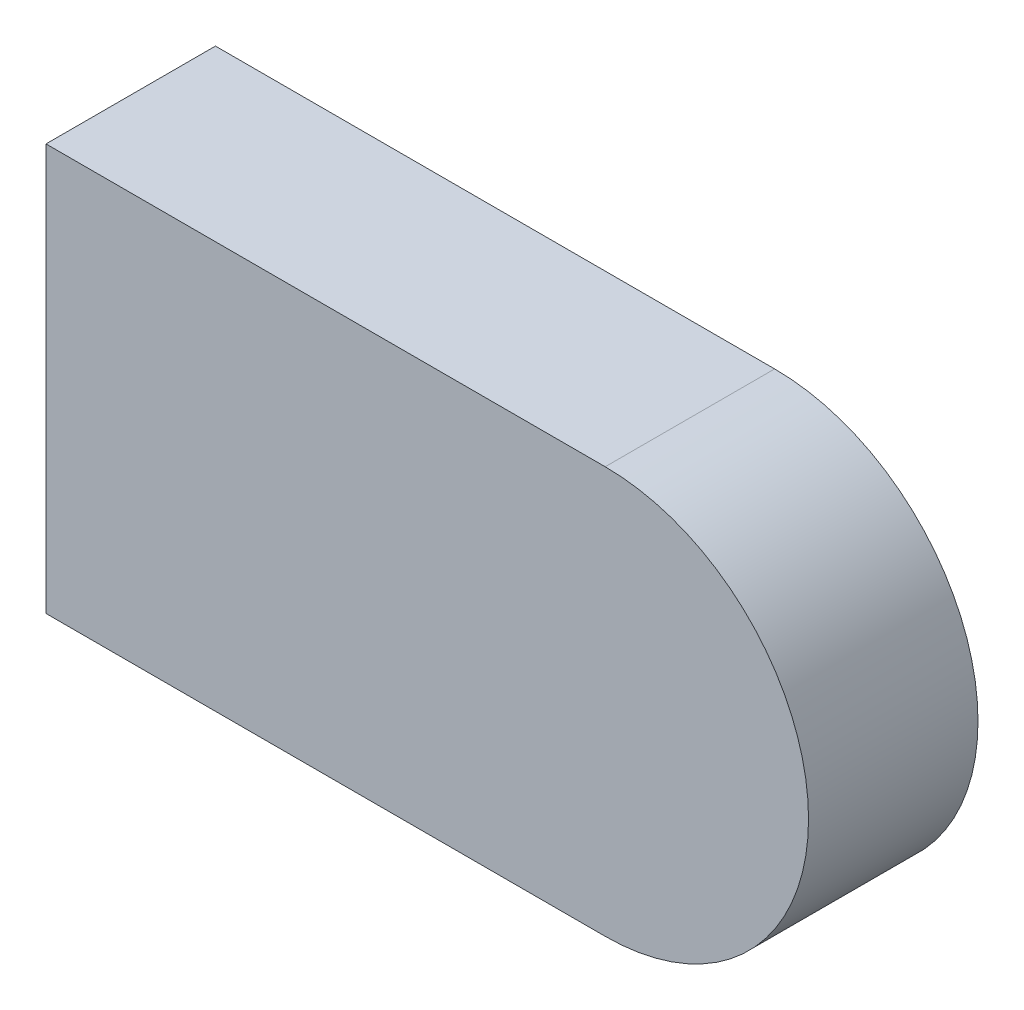
ISO-10303-21;
HEADER;
FILE_DESCRIPTION(('STEP AP214'),'2;1');
FILE_NAME('part.step','',(''),(''),'','','');
FILE_SCHEMA(('AUTOMOTIVE_DESIGN { 1 0 10303 214 1 1 1 1 }'));
ENDSEC;
DATA;
#1=APPLICATION_CONTEXT('core data for automotive mechanical design processes');
#2=APPLICATION_PROTOCOL_DEFINITION('international standard','automotive_design',2000,#1);
#3=PRODUCT_CONTEXT('',#1,'mechanical');
#4=PRODUCT('Part','Part','',(#3));
#5=PRODUCT_RELATED_PRODUCT_CATEGORY('part','',(#4));
#6=PRODUCT_DEFINITION_FORMATION('','',#4);
#7=PRODUCT_DEFINITION_CONTEXT('part definition',#1,'design');
#8=PRODUCT_DEFINITION('design','',#6,#7);
#9=PRODUCT_DEFINITION_SHAPE('','',#8);
#10=(LENGTH_UNIT() NAMED_UNIT(*) SI_UNIT(.MILLI.,.METRE.));
#11=(NAMED_UNIT(*) PLANE_ANGLE_UNIT() SI_UNIT($,.RADIAN.));
#12=(NAMED_UNIT(*) SI_UNIT($,.STERADIAN.) SOLID_ANGLE_UNIT());
#13=UNCERTAINTY_MEASURE_WITH_UNIT(LENGTH_MEASURE(1.E-05),#10,'distance_accuracy_value','');
#14=(GEOMETRIC_REPRESENTATION_CONTEXT(3) GLOBAL_UNCERTAINTY_ASSIGNED_CONTEXT((#13)) GLOBAL_UNIT_ASSIGNED_CONTEXT((#10,
#11,#12)) REPRESENTATION_CONTEXT('',''));
#15=CARTESIAN_POINT('',(0.,0.,0.));
#16=DIRECTION('',(0.,0.,1.));
#17=DIRECTION('',(1.,0.,0.));
#18=AXIS2_PLACEMENT_3D('',#15,#16,#17);
#19=CARTESIAN_POINT('',(-4.05,0.63,0.));
#20=DIRECTION('',(0.,1.,0.));
#21=DIRECTION('',(1.,0.,0.));
#22=AXIS2_PLACEMENT_3D('',#19,#20,#21);
#23=PLANE('',#22);
#24=DIRECTION('',(1.,0.,0.));
#25=VECTOR('',#24,1.);
#26=CARTESIAN_POINT('',(-4.05,0.63,0.));
#27=LINE('',#26,#25);
#28=CARTESIAN_POINT('',(-4.05,0.63,0.));
#29=VERTEX_POINT('',#28);
#30=CARTESIAN_POINT('',(-3.72,0.63,0.));
#31=VERTEX_POINT('',#30);
#32=EDGE_CURVE('E11',#29,#31,#27,.T.);
#33=ORIENTED_EDGE('',*,*,#32,.T.);
#34=DIRECTION('',(0.,0.,1.));
#35=VECTOR('',#34,1.);
#36=CARTESIAN_POINT('',(-3.72,0.63,0.));
#37=LINE('',#36,#35);
#38=CARTESIAN_POINT('',(-3.72,0.63,0.1));
#39=VERTEX_POINT('',#38);
#40=EDGE_CURVE('E24',#31,#39,#37,.T.);
#41=ORIENTED_EDGE('',*,*,#40,.T.);
#42=DIRECTION('',(1.,0.,0.));
#43=VECTOR('',#42,1.);
#44=CARTESIAN_POINT('',(-4.05,0.63,0.1));
#45=LINE('',#44,#43);
#46=CARTESIAN_POINT('',(-4.05,0.63,0.1));
#47=VERTEX_POINT('',#46);
#48=EDGE_CURVE('E88',#47,#39,#45,.T.);
#49=ORIENTED_EDGE('',*,*,#48,.F.);
#50=DIRECTION('',(0.,0.,1.));
#51=VECTOR('',#50,1.);
#52=CARTESIAN_POINT('',(-4.05,0.63,0.));
#53=LINE('',#52,#51);
#54=EDGE_CURVE('E36',#29,#47,#53,.T.);
#55=ORIENTED_EDGE('',*,*,#54,.F.);
#56=EDGE_LOOP('',(#33,#41,#49,#55));
#57=FACE_BOUND('',#56,.T.);
#58=ADVANCED_FACE('F17',(#57),#23,.F.);
#59=CARTESIAN_POINT('',(-3.72,0.75,0.));
#60=DIRECTION('',(0.,0.,-1.));
#61=DIRECTION('',(1.,0.,0.));
#62=AXIS2_PLACEMENT_3D('',#59,#60,#61);
#63=CYLINDRICAL_SURFACE('',#62,0.12);
#64=CARTESIAN_POINT('',(-3.72,0.75,0.));
#65=DIRECTION('',(0.,0.,1.));
#66=DIRECTION('',(1.,0.,0.));
#67=AXIS2_PLACEMENT_3D('',#64,#65,#66);
#68=CIRCLE('',#67,0.12);
#69=CARTESIAN_POINT('',(-3.72,0.87,0.));
#70=VERTEX_POINT('',#69);
#71=EDGE_CURVE('E85',#31,#70,#68,.T.);
#72=ORIENTED_EDGE('',*,*,#71,.T.);
#73=DIRECTION('',(0.,0.,1.));
#74=VECTOR('',#73,1.);
#75=CARTESIAN_POINT('',(-3.72,0.87,0.));
#76=LINE('',#75,#74);
#77=CARTESIAN_POINT('',(-3.72,0.87,0.1));
#78=VERTEX_POINT('',#77);
#79=EDGE_CURVE('E73',#70,#78,#76,.T.);
#80=ORIENTED_EDGE('',*,*,#79,.T.);
#81=CARTESIAN_POINT('',(-3.72,0.75,0.1));
#82=DIRECTION('',(0.,0.,1.));
#83=DIRECTION('',(1.,0.,0.));
#84=AXIS2_PLACEMENT_3D('',#81,#82,#83);
#85=CIRCLE('',#84,0.12);
#86=EDGE_CURVE('E66',#39,#78,#85,.T.);
#87=ORIENTED_EDGE('',*,*,#86,.F.);
#88=ORIENTED_EDGE('',*,*,#40,.F.);
#89=EDGE_LOOP('',(#72,#80,#87,#88));
#90=FACE_BOUND('',#89,.T.);
#91=ADVANCED_FACE('F89',(#90),#63,.T.);
#92=CARTESIAN_POINT('',(-4.05,0.87,0.));
#93=DIRECTION('',(0.,1.,0.));
#94=DIRECTION('',(1.,0.,0.));
#95=AXIS2_PLACEMENT_3D('',#92,#93,#94);
#96=PLANE('',#95);
#97=DIRECTION('',(0.,0.,1.));
#98=VECTOR('',#97,1.);
#99=CARTESIAN_POINT('',(-4.05,0.87,0.));
#100=LINE('',#99,#98);
#101=CARTESIAN_POINT('',(-4.05,0.87,0.));
#102=VERTEX_POINT('',#101);
#103=CARTESIAN_POINT('',(-4.05,0.87,0.1));
#104=VERTEX_POINT('',#103);
#105=EDGE_CURVE('E56',#102,#104,#100,.T.);
#106=ORIENTED_EDGE('',*,*,#105,.T.);
#107=DIRECTION('',(1.,0.,0.));
#108=VECTOR('',#107,1.);
#109=CARTESIAN_POINT('',(-4.05,0.87,0.1));
#110=LINE('',#109,#108);
#111=EDGE_CURVE('E67',#104,#78,#110,.T.);
#112=ORIENTED_EDGE('',*,*,#111,.T.);
#113=ORIENTED_EDGE('',*,*,#79,.F.);
#114=DIRECTION('',(1.,0.,0.));
#115=VECTOR('',#114,1.);
#116=CARTESIAN_POINT('',(-4.05,0.87,0.));
#117=LINE('',#116,#115);
#118=EDGE_CURVE('E71',#102,#70,#117,.T.);
#119=ORIENTED_EDGE('',*,*,#118,.F.);
#120=EDGE_LOOP('',(#106,#112,#113,#119));
#121=FACE_BOUND('',#120,.T.);
#122=ADVANCED_FACE('F72',(#121),#96,.T.);
#123=CARTESIAN_POINT('',(-4.05,0.63,0.));
#124=DIRECTION('',(-1.,0.,0.));
#125=DIRECTION('',(0.,1.,0.));
#126=AXIS2_PLACEMENT_3D('',#123,#124,#125);
#127=PLANE('',#126);
#128=ORIENTED_EDGE('',*,*,#54,.T.);
#129=DIRECTION('',(0.,1.,0.));
#130=VECTOR('',#129,1.);
#131=CARTESIAN_POINT('',(-4.05,0.63,0.1));
#132=LINE('',#131,#130);
#133=EDGE_CURVE('E62',#47,#104,#132,.T.);
#134=ORIENTED_EDGE('',*,*,#133,.T.);
#135=ORIENTED_EDGE('',*,*,#105,.F.);
#136=DIRECTION('',(0.,1.,0.));
#137=VECTOR('',#136,1.);
#138=CARTESIAN_POINT('',(-4.05,0.63,0.));
#139=LINE('',#138,#137);
#140=EDGE_CURVE('E60',#29,#102,#139,.T.);
#141=ORIENTED_EDGE('',*,*,#140,.F.);
#142=EDGE_LOOP('',(#128,#134,#135,#141));
#143=FACE_BOUND('',#142,.T.);
#144=ADVANCED_FACE('F58',(#143),#127,.T.);
#145=CARTESIAN_POINT('',(-3.849490847913,0.75,0.));
#146=DIRECTION('',(0.,0.,1.));
#147=DIRECTION('',(1.,0.,0.));
#148=AXIS2_PLACEMENT_3D('',#145,#146,#147);
#149=PLANE('',#148);
#150=ORIENTED_EDGE('',*,*,#140,.T.);
#151=ORIENTED_EDGE('',*,*,#118,.T.);
#152=ORIENTED_EDGE('',*,*,#71,.F.);
#153=ORIENTED_EDGE('',*,*,#32,.F.);
#154=EDGE_LOOP('',(#150,#151,#152,#153));
#155=FACE_BOUND('',#154,.T.);
#156=ADVANCED_FACE('F77',(#155),#149,.F.);
#157=CARTESIAN_POINT('',(-3.849490847913,0.75,0.1));
#158=DIRECTION('',(0.,0.,1.));
#159=DIRECTION('',(1.,0.,0.));
#160=AXIS2_PLACEMENT_3D('',#157,#158,#159);
#161=PLANE('',#160);
#162=ORIENTED_EDGE('',*,*,#48,.T.);
#163=ORIENTED_EDGE('',*,*,#86,.T.);
#164=ORIENTED_EDGE('',*,*,#111,.F.);
#165=ORIENTED_EDGE('',*,*,#133,.F.);
#166=EDGE_LOOP('',(#162,#163,#164,#165));
#167=FACE_BOUND('',#166,.T.);
#168=ADVANCED_FACE('F91',(#167),#161,.T.);
#169=CLOSED_SHELL('',(#58,#91,#122,#144,#156,#168));
#170=MANIFOLD_SOLID_BREP('B1',#169);
#171=ADVANCED_BREP_SHAPE_REPRESENTATION('',(#18,#170),#14);
#172=SHAPE_DEFINITION_REPRESENTATION(#9,#171);
ENDSEC;
END-ISO-10303-21;
